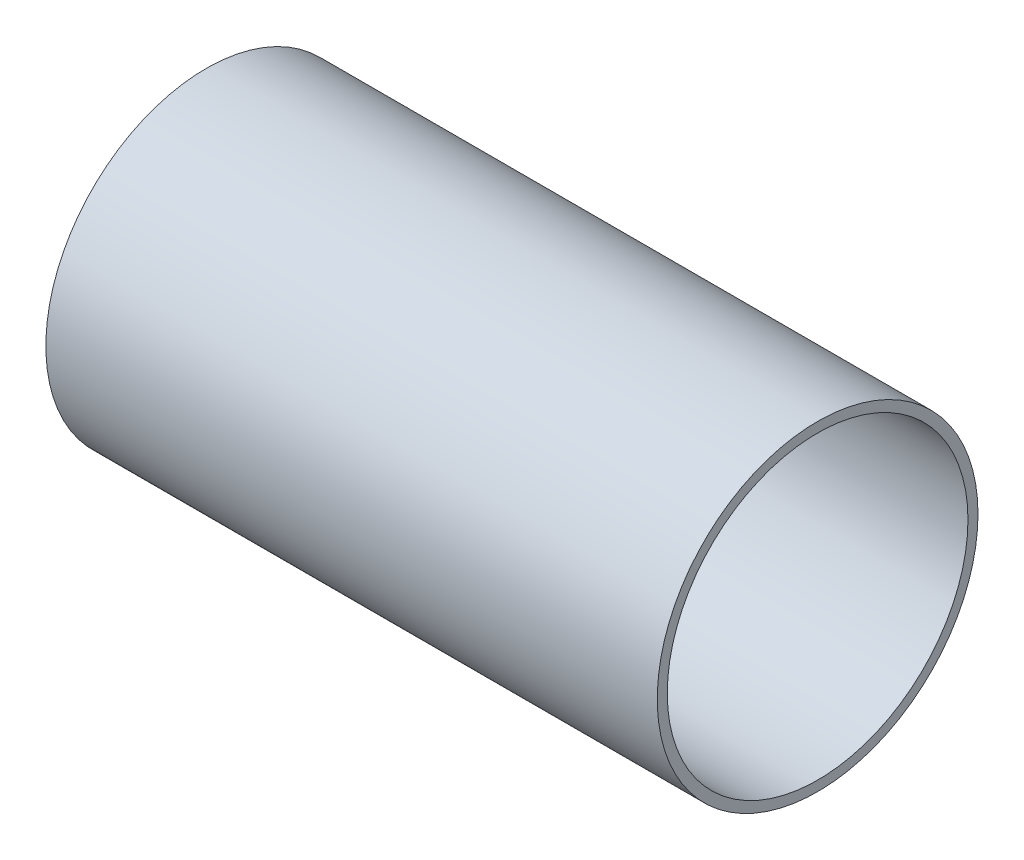
ISO-10303-21;
HEADER;
FILE_DESCRIPTION(('STEP AP214'),'2;1');
FILE_NAME('part.step','',(''),(''),'','','');
FILE_SCHEMA(('AUTOMOTIVE_DESIGN { 1 0 10303 214 1 1 1 1 }'));
ENDSEC;
DATA;
#1=APPLICATION_CONTEXT('core data for automotive mechanical design processes');
#2=APPLICATION_PROTOCOL_DEFINITION('international standard','automotive_design',2000,#1);
#3=PRODUCT_CONTEXT('',#1,'mechanical');
#4=PRODUCT('Part','Part','',(#3));
#5=PRODUCT_RELATED_PRODUCT_CATEGORY('part','',(#4));
#6=PRODUCT_DEFINITION_FORMATION('','',#4);
#7=PRODUCT_DEFINITION_CONTEXT('part definition',#1,'design');
#8=PRODUCT_DEFINITION('design','',#6,#7);
#9=PRODUCT_DEFINITION_SHAPE('','',#8);
#10=(LENGTH_UNIT() NAMED_UNIT(*) SI_UNIT(.MILLI.,.METRE.));
#11=(NAMED_UNIT(*) PLANE_ANGLE_UNIT() SI_UNIT($,.RADIAN.));
#12=(NAMED_UNIT(*) SI_UNIT($,.STERADIAN.) SOLID_ANGLE_UNIT());
#13=UNCERTAINTY_MEASURE_WITH_UNIT(LENGTH_MEASURE(1.E-05),#10,'distance_accuracy_value','');
#14=(GEOMETRIC_REPRESENTATION_CONTEXT(3) GLOBAL_UNCERTAINTY_ASSIGNED_CONTEXT((#13)) GLOBAL_UNIT_ASSIGNED_CONTEXT((#10,
#11,#12)) REPRESENTATION_CONTEXT('',''));
#15=CARTESIAN_POINT('',(0.,0.,0.));
#16=DIRECTION('',(0.,0.,1.));
#17=DIRECTION('',(1.,0.,0.));
#18=AXIS2_PLACEMENT_3D('',#15,#16,#17);
#19=CARTESIAN_POINT('',(387.35,0.,0.));
#20=DIRECTION('',(1.,0.,0.));
#21=DIRECTION('',(0.,0.,-1.));
#22=AXIS2_PLACEMENT_3D('',#19,#20,#21);
#23=PLANE('',#22);
#24=CARTESIAN_POINT('',(387.35,0.,0.));
#25=DIRECTION('',(1.,0.,0.));
#26=DIRECTION('',(0.,0.,-1.));
#27=AXIS2_PLACEMENT_3D('',#24,#25,#26);
#28=CIRCLE('',#27,101.6);
#29=CARTESIAN_POINT('',(387.35,0.,-101.6));
#30=VERTEX_POINT('',#29);
#31=EDGE_CURVE('E10',#30,#30,#28,.T.);
#32=ORIENTED_EDGE('',*,*,#31,.T.);
#33=EDGE_LOOP('',(#32));
#34=FACE_BOUND('',#33,.T.);
#35=CARTESIAN_POINT('',(387.35,0.,0.));
#36=DIRECTION('',(1.,0.,0.));
#37=DIRECTION('',(0.,0.,-1.));
#38=AXIS2_PLACEMENT_3D('',#35,#36,#37);
#39=CIRCLE('',#38,95.25);
#40=CARTESIAN_POINT('',(387.35,0.,-95.25));
#41=VERTEX_POINT('',#40);
#42=EDGE_CURVE('E42',#41,#41,#39,.T.);
#43=ORIENTED_EDGE('',*,*,#42,.F.);
#44=EDGE_LOOP('',(#43));
#45=FACE_BOUND('',#44,.T.);
#46=ADVANCED_FACE('F31',(#34,#45),#23,.T.);
#47=CARTESIAN_POINT('',(0.,0.,0.));
#48=DIRECTION('',(1.,0.,0.));
#49=DIRECTION('',(0.,0.,-1.));
#50=AXIS2_PLACEMENT_3D('',#47,#48,#49);
#51=PLANE('',#50);
#52=CARTESIAN_POINT('',(0.,0.,0.));
#53=DIRECTION('',(1.,0.,0.));
#54=DIRECTION('',(0.,0.,-1.));
#55=AXIS2_PLACEMENT_3D('',#52,#53,#54);
#56=CIRCLE('',#55,101.6);
#57=CARTESIAN_POINT('',(0.,0.,-101.6));
#58=VERTEX_POINT('',#57);
#59=EDGE_CURVE('E35',#58,#58,#56,.T.);
#60=ORIENTED_EDGE('',*,*,#59,.F.);
#61=EDGE_LOOP('',(#60));
#62=FACE_BOUND('',#61,.T.);
#63=CARTESIAN_POINT('',(0.,0.,0.));
#64=DIRECTION('',(1.,0.,0.));
#65=DIRECTION('',(0.,0.,-1.));
#66=AXIS2_PLACEMENT_3D('',#63,#64,#65);
#67=CIRCLE('',#66,95.25);
#68=CARTESIAN_POINT('',(0.,0.,-95.25));
#69=VERTEX_POINT('',#68);
#70=EDGE_CURVE('E44',#69,#69,#67,.T.);
#71=ORIENTED_EDGE('',*,*,#70,.T.);
#72=EDGE_LOOP('',(#71));
#73=FACE_BOUND('',#72,.T.);
#74=ADVANCED_FACE('F54',(#62,#73),#51,.F.);
#75=CARTESIAN_POINT('',(387.35,0.,0.));
#76=DIRECTION('',(-1.,0.,0.));
#77=DIRECTION('',(0.,0.,1.));
#78=AXIS2_PLACEMENT_3D('',#75,#76,#77);
#79=CYLINDRICAL_SURFACE('',#78,101.6);
#80=ORIENTED_EDGE('',*,*,#31,.F.);
#81=EDGE_LOOP('',(#80));
#82=FACE_BOUND('',#81,.T.);
#83=ORIENTED_EDGE('',*,*,#59,.T.);
#84=EDGE_LOOP('',(#83));
#85=FACE_BOUND('',#84,.T.);
#86=ADVANCED_FACE('F33',(#82,#85),#79,.T.);
#87=CARTESIAN_POINT('',(387.35,0.,0.));
#88=DIRECTION('',(-1.,0.,0.));
#89=DIRECTION('',(0.,0.,1.));
#90=AXIS2_PLACEMENT_3D('',#87,#88,#89);
#91=CYLINDRICAL_SURFACE('',#90,95.25);
#92=ORIENTED_EDGE('',*,*,#42,.T.);
#93=EDGE_LOOP('',(#92));
#94=FACE_BOUND('',#93,.T.);
#95=ORIENTED_EDGE('',*,*,#70,.F.);
#96=EDGE_LOOP('',(#95));
#97=FACE_BOUND('',#96,.T.);
#98=ADVANCED_FACE('F50',(#94,#97),#91,.F.);
#99=CLOSED_SHELL('',(#46,#74,#86,#98));
#100=MANIFOLD_SOLID_BREP('B2',#99);
#101=ADVANCED_BREP_SHAPE_REPRESENTATION('',(#18,#100),#14);
#102=SHAPE_DEFINITION_REPRESENTATION(#9,#101);
ENDSEC;
END-ISO-10303-21;
